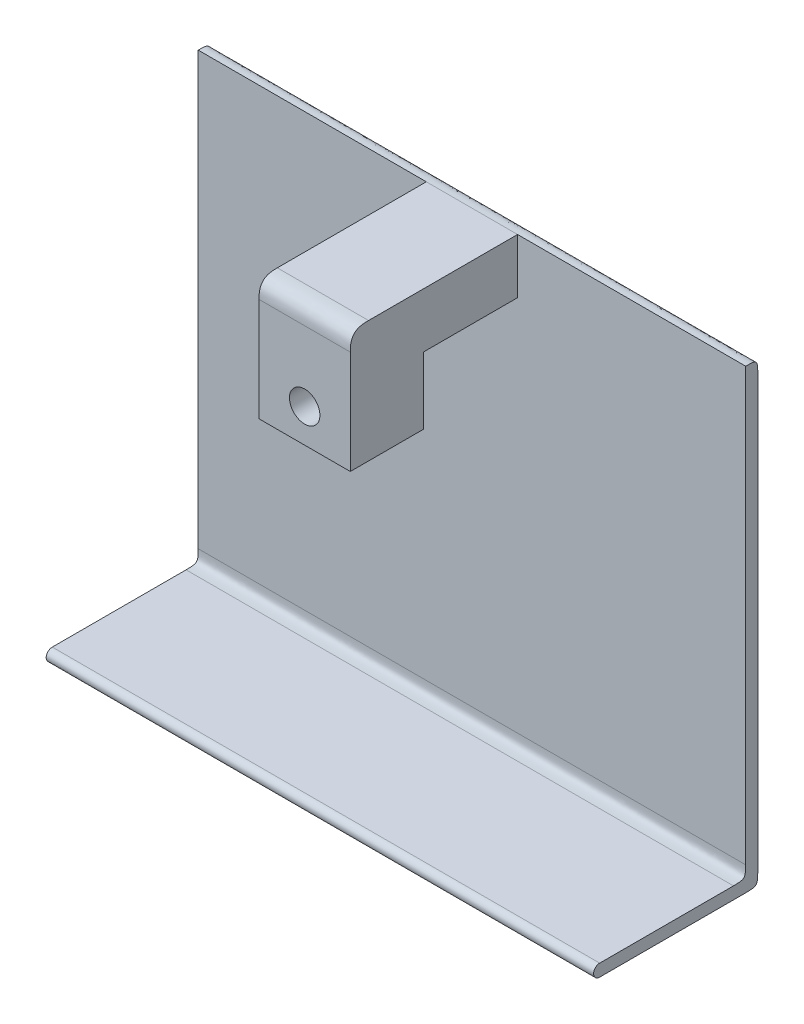
ISO-10303-21;
HEADER;
FILE_DESCRIPTION(('STEP AP214'),'2;1');
FILE_NAME('part.step','',(''),(''),'','','');
FILE_SCHEMA(('AUTOMOTIVE_DESIGN { 1 0 10303 214 1 1 1 1 }'));
ENDSEC;
DATA;
#1=APPLICATION_CONTEXT('core data for automotive mechanical design processes');
#2=APPLICATION_PROTOCOL_DEFINITION('international standard','automotive_design',2000,#1);
#3=PRODUCT_CONTEXT('',#1,'mechanical');
#4=PRODUCT('Part','Part','',(#3));
#5=PRODUCT_RELATED_PRODUCT_CATEGORY('part','',(#4));
#6=PRODUCT_DEFINITION_FORMATION('','',#4);
#7=PRODUCT_DEFINITION_CONTEXT('part definition',#1,'design');
#8=PRODUCT_DEFINITION('design','',#6,#7);
#9=PRODUCT_DEFINITION_SHAPE('','',#8);
#10=(LENGTH_UNIT() NAMED_UNIT(*) SI_UNIT(.MILLI.,.METRE.));
#11=(NAMED_UNIT(*) PLANE_ANGLE_UNIT() SI_UNIT($,.RADIAN.));
#12=(NAMED_UNIT(*) SI_UNIT($,.STERADIAN.) SOLID_ANGLE_UNIT());
#13=UNCERTAINTY_MEASURE_WITH_UNIT(LENGTH_MEASURE(1.E-05),#10,'distance_accuracy_value','');
#14=(GEOMETRIC_REPRESENTATION_CONTEXT(3) GLOBAL_UNCERTAINTY_ASSIGNED_CONTEXT((#13)) GLOBAL_UNIT_ASSIGNED_CONTEXT((#10,
#11,#12)) REPRESENTATION_CONTEXT('',''));
#15=CARTESIAN_POINT('',(0.,0.,0.));
#16=DIRECTION('',(0.,0.,1.));
#17=DIRECTION('',(1.,0.,0.));
#18=AXIS2_PLACEMENT_3D('',#15,#16,#17);
#19=CARTESIAN_POINT('',(-225.,-270.,12.5));
#20=DIRECTION('',(-1.,0.,0.));
#21=DIRECTION('',(0.,0.,1.));
#22=AXIS2_PLACEMENT_3D('',#19,#20,#21);
#23=CYLINDRICAL_SURFACE('',#22,5.);
#24=DIRECTION('',(-1.,0.,0.));
#25=VECTOR('',#24,1.);
#26=CARTESIAN_POINT('',(-225.,-265.,12.5));
#27=LINE('',#26,#25);
#28=CARTESIAN_POINT('',(-225.,-265.,12.5));
#29=VERTEX_POINT('',#28);
#30=CARTESIAN_POINT('',(225.,-265.,12.5));
#31=VERTEX_POINT('',#30);
#32=EDGE_CURVE('E488',#29,#31,#27,.F.);
#33=ORIENTED_EDGE('',*,*,#32,.F.);
#34=CARTESIAN_POINT('',(-225.,-270.,12.5));
#35=DIRECTION('',(1.,0.,0.));
#36=DIRECTION('',(0.,1.,0.));
#37=AXIS2_PLACEMENT_3D('',#34,#35,#36);
#38=CIRCLE('',#37,5.);
#39=CARTESIAN_POINT('',(-225.,-275.,12.5));
#40=VERTEX_POINT('',#39);
#41=EDGE_CURVE('E491',#40,#29,#38,.F.);
#42=ORIENTED_EDGE('',*,*,#41,.F.);
#43=DIRECTION('',(-1.,0.,0.));
#44=VECTOR('',#43,1.);
#45=CARTESIAN_POINT('',(-25.,-275.,12.5));
#46=LINE('',#45,#44);
#47=CARTESIAN_POINT('',(225.,-275.,12.5));
#48=VERTEX_POINT('',#47);
#49=EDGE_CURVE('E496',#48,#40,#46,.T.);
#50=ORIENTED_EDGE('',*,*,#49,.F.);
#51=CARTESIAN_POINT('',(225.,-270.,12.5));
#52=DIRECTION('',(-1.,0.,0.));
#53=DIRECTION('',(0.,-1.,0.));
#54=AXIS2_PLACEMENT_3D('',#51,#52,#53);
#55=CIRCLE('',#54,5.);
#56=EDGE_CURVE('E493',#31,#48,#55,.F.);
#57=ORIENTED_EDGE('',*,*,#56,.F.);
#58=EDGE_LOOP('',(#33,#42,#50,#57));
#59=FACE_BOUND('',#58,.T.);
#60=ADVANCED_FACE('F38',(#59),#23,.T.);
#61=CARTESIAN_POINT('',(0.,0.,-107.5));
#62=DIRECTION('',(0.,0.,-1.));
#63=DIRECTION('',(-1.,0.,0.));
#64=AXIS2_PLACEMENT_3D('',#61,#62,#63);
#65=PLANE('',#64);
#66=DIRECTION('',(0.,1.,0.));
#67=VECTOR('',#66,1.);
#68=CARTESIAN_POINT('',(-225.,100.,-107.5));
#69=LINE('',#68,#67);
#70=CARTESIAN_POINT('',(-225.,-255.,-107.5));
#71=VERTEX_POINT('',#70);
#72=CARTESIAN_POINT('',(-225.,100.,-107.5));
#73=VERTEX_POINT('',#72);
#74=EDGE_CURVE('E179',#71,#73,#69,.T.);
#75=ORIENTED_EDGE('',*,*,#74,.F.);
#76=CARTESIAN_POINT('',(247.5,-255.,-107.5));
#77=CARTESIAN_POINT('',(82.5,-255.,-107.5));
#78=CARTESIAN_POINT('',(-82.4999999999999,-255.,-107.5));
#79=CARTESIAN_POINT('',(-247.5,-255.,-107.5));
#80=(BOUNDED_CURVE() B_SPLINE_CURVE(3,(#76,#77,#78,#79),.UNSPECIFIED.,.F.,
.F.) B_SPLINE_CURVE_WITH_KNOTS((4,4),(-0.0225,0.4725),
.UNSPECIFIED.) CURVE() GEOMETRIC_REPRESENTATION_ITEM() RATIONAL_B_SPLINE_CURVE((1.,1.,1.,1.)) REPRESENTATION_ITEM(''));
#81=CARTESIAN_POINT('',(225.,-255.,-107.5));
#82=VERTEX_POINT('',#81);
#83=EDGE_CURVE('E177',#71,#82,#80,.F.);
#84=ORIENTED_EDGE('',*,*,#83,.T.);
#85=DIRECTION('',(0.,-1.,0.));
#86=VECTOR('',#85,1.);
#87=CARTESIAN_POINT('',(225.,100.,-107.5));
#88=LINE('',#87,#86);
#89=CARTESIAN_POINT('',(225.,100.,-107.5));
#90=VERTEX_POINT('',#89);
#91=EDGE_CURVE('E155',#90,#82,#88,.T.);
#92=ORIENTED_EDGE('',*,*,#91,.F.);
#93=CARTESIAN_POINT('',(-247.5,100.,-107.5));
#94=CARTESIAN_POINT('',(-82.5,100.,-107.5));
#95=CARTESIAN_POINT('',(82.5,100.,-107.5));
#96=CARTESIAN_POINT('',(247.5,100.,-107.5));
#97=(BOUNDED_CURVE() B_SPLINE_CURVE(3,(#93,#94,#95,#96),.UNSPECIFIED.,.F.,
.F.) B_SPLINE_CURVE_WITH_KNOTS((4,4),(-0.2475,0.2475),
.UNSPECIFIED.) CURVE() GEOMETRIC_REPRESENTATION_ITEM() RATIONAL_B_SPLINE_CURVE((1.,1.,1.,1.)) REPRESENTATION_ITEM(''));
#98=CARTESIAN_POINT('',(37.5,100.,-107.5));
#99=VERTEX_POINT('',#98);
#100=EDGE_CURVE('E173',#99,#90,#97,.T.);
#101=ORIENTED_EDGE('',*,*,#100,.F.);
#102=DIRECTION('',(0.,-1.,0.));
#103=VECTOR('',#102,1.);
#104=CARTESIAN_POINT('',(37.5,100.,-107.5));
#105=LINE('',#104,#103);
#106=CARTESIAN_POINT('',(37.5,55.,-107.5));
#107=VERTEX_POINT('',#106);
#108=EDGE_CURVE('E326',#99,#107,#105,.T.);
#109=ORIENTED_EDGE('',*,*,#108,.T.);
#110=DIRECTION('',(-1.,0.,0.));
#111=VECTOR('',#110,1.);
#112=CARTESIAN_POINT('',(37.5,55.,-107.5));
#113=LINE('',#112,#111);
#114=CARTESIAN_POINT('',(-37.5,55.,-107.5));
#115=VERTEX_POINT('',#114);
#116=EDGE_CURVE('E328',#107,#115,#113,.T.);
#117=ORIENTED_EDGE('',*,*,#116,.T.);
#118=DIRECTION('',(0.,1.,0.));
#119=VECTOR('',#118,1.);
#120=CARTESIAN_POINT('',(-37.5,100.,-107.5));
#121=LINE('',#120,#119);
#122=CARTESIAN_POINT('',(-37.5,100.,-107.5));
#123=VERTEX_POINT('',#122);
#124=EDGE_CURVE('E333',#115,#123,#121,.T.);
#125=ORIENTED_EDGE('',*,*,#124,.T.);
#126=CARTESIAN_POINT('',(-247.5,100.,-107.5));
#127=CARTESIAN_POINT('',(-82.5,100.,-107.5));
#128=CARTESIAN_POINT('',(82.5,100.,-107.5));
#129=CARTESIAN_POINT('',(247.5,100.,-107.5));
#130=(BOUNDED_CURVE() B_SPLINE_CURVE(3,(#126,#127,#128,#129),.UNSPECIFIED.,.F.,
.F.) B_SPLINE_CURVE_WITH_KNOTS((4,4),(-0.2475,0.2475),
.UNSPECIFIED.) CURVE() GEOMETRIC_REPRESENTATION_ITEM() RATIONAL_B_SPLINE_CURVE((1.,1.,1.,1.)) REPRESENTATION_ITEM(''));
#131=EDGE_CURVE('E188',#73,#123,#130,.T.);
#132=ORIENTED_EDGE('',*,*,#131,.F.);
#133=EDGE_LOOP('',(#75,#84,#92,#101,#109,#117,#125,#132));
#134=FACE_BOUND('',#133,.T.);
#135=ADVANCED_FACE('F171',(#134),#65,.F.);
#136=CARTESIAN_POINT('',(-37.5,100.,30.));
#137=DIRECTION('',(-1.,0.,0.));
#138=DIRECTION('',(0.,0.,1.));
#139=AXIS2_PLACEMENT_3D('',#136,#137,#138);
#140=PLANE('',#139);
#141=DIRECTION('',(0.,-1.,0.));
#142=VECTOR('',#141,1.);
#143=CARTESIAN_POINT('',(-37.5,100.,30.));
#144=LINE('',#143,#142);
#145=CARTESIAN_POINT('',(-37.5,85.,30.));
#146=VERTEX_POINT('',#145);
#147=CARTESIAN_POINT('',(-37.5,0.,30.));
#148=VERTEX_POINT('',#147);
#149=EDGE_CURVE('E397',#146,#148,#144,.T.);
#150=ORIENTED_EDGE('',*,*,#149,.F.);
#151=CARTESIAN_POINT('',(-37.5,100.,15.));
#152=CARTESIAN_POINT('',(-37.5,100.,17.5229707730092));
#153=CARTESIAN_POINT('',(-37.5,100.,20.0459415460184));
#154=CARTESIAN_POINT('',(-37.5,98.9246212024588,25.6066017177982));
#155=CARTESIAN_POINT('',(-37.5,95.6066017177982,28.9246212024587));
#156=CARTESIAN_POINT('',(-37.5,90.0459415460184,30.));
#157=CARTESIAN_POINT('',(-37.5,87.5229707730092,30.));
#158=CARTESIAN_POINT('',(-37.5,85.,30.));
#159=B_SPLINE_CURVE_WITH_KNOTS('',5,(#151,#152,#153,#154,#155,#156,#157,#158),.UNSPECIFIED.,.F.,
.F.,(6,2,6),(0.,0.5,1.),.UNSPECIFIED.);
#160=CARTESIAN_POINT('',(-37.5,100.,15.));
#161=VERTEX_POINT('',#160);
#162=EDGE_CURVE('E12',#146,#161,#159,.F.);
#163=ORIENTED_EDGE('',*,*,#162,.T.);
#164=DIRECTION('',(0.,0.,-1.));
#165=VECTOR('',#164,1.);
#166=CARTESIAN_POINT('',(-37.5,100.,30.));
#167=LINE('',#166,#165);
#168=EDGE_CURVE('E316',#161,#123,#167,.T.);
#169=ORIENTED_EDGE('',*,*,#168,.T.);
#170=ORIENTED_EDGE('',*,*,#124,.F.);
#171=DIRECTION('',(0.,0.,1.));
#172=VECTOR('',#171,1.);
#173=CARTESIAN_POINT('',(-37.5,55.,-107.5));
#174=LINE('',#173,#172);
#175=CARTESIAN_POINT('',(-37.5,55.,-30.));
#176=VERTEX_POINT('',#175);
#177=EDGE_CURVE('E336',#115,#176,#174,.T.);
#178=ORIENTED_EDGE('',*,*,#177,.T.);
#179=DIRECTION('',(0.,-1.,0.));
#180=VECTOR('',#179,1.);
#181=CARTESIAN_POINT('',(-37.5,100.,-30.));
#182=LINE('',#181,#180);
#183=CARTESIAN_POINT('',(-37.5,0.,-30.));
#184=VERTEX_POINT('',#183);
#185=EDGE_CURVE('E315',#176,#184,#182,.T.);
#186=ORIENTED_EDGE('',*,*,#185,.T.);
#187=DIRECTION('',(0.,0.,-1.));
#188=VECTOR('',#187,1.);
#189=CARTESIAN_POINT('',(-37.5,0.,30.));
#190=LINE('',#189,#188);
#191=EDGE_CURVE('E608',#148,#184,#190,.T.);
#192=ORIENTED_EDGE('',*,*,#191,.F.);
#193=EDGE_LOOP('',(#150,#163,#169,#170,#178,#186,#192));
#194=FACE_BOUND('',#193,.T.);
#195=ADVANCED_FACE('F446',(#194),#140,.T.);
#196=CARTESIAN_POINT('',(-37.5,100.,30.));
#197=DIRECTION('',(0.,0.,-1.));
#198=DIRECTION('',(-1.,0.,0.));
#199=AXIS2_PLACEMENT_3D('',#196,#197,#198);
#200=PLANE('',#199);
#201=CARTESIAN_POINT('',(0.,27.5013680983625,30.));
#202=DIRECTION('',(0.,0.,1.));
#203=DIRECTION('',(1.,0.,0.));
#204=AXIS2_PLACEMENT_3D('',#201,#202,#203);
#205=CIRCLE('',#204,12.5);
#206=CARTESIAN_POINT('',(12.5,27.5013680983625,30.));
#207=VERTEX_POINT('',#206);
#208=EDGE_CURVE('E509',#207,#207,#205,.T.);
#209=ORIENTED_EDGE('',*,*,#208,.F.);
#210=EDGE_LOOP('',(#209));
#211=FACE_BOUND('',#210,.T.);
#212=DIRECTION('',(0.,-1.,0.));
#213=VECTOR('',#212,1.);
#214=CARTESIAN_POINT('',(37.5,100.,30.));
#215=LINE('',#214,#213);
#216=CARTESIAN_POINT('',(37.5,85.,30.));
#217=VERTEX_POINT('',#216);
#218=CARTESIAN_POINT('',(37.5,0.,30.));
#219=VERTEX_POINT('',#218);
#220=EDGE_CURVE('E399',#217,#219,#215,.T.);
#221=ORIENTED_EDGE('',*,*,#220,.F.);
#222=CARTESIAN_POINT('',(-41.25,85.,30.));
#223=CARTESIAN_POINT('',(-13.75,85.,30.));
#224=CARTESIAN_POINT('',(13.75,85.,30.));
#225=CARTESIAN_POINT('',(41.25,85.,30.));
#226=B_SPLINE_CURVE_WITH_KNOTS('',3,(#222,#223,#224,#225),.UNSPECIFIED.,.F.,.F.,(4,4),(-0.04125,
0.04125),.UNSPECIFIED.);
#227=EDGE_CURVE('E51',#217,#146,#226,.F.);
#228=ORIENTED_EDGE('',*,*,#227,.T.);
#229=ORIENTED_EDGE('',*,*,#149,.T.);
#230=DIRECTION('',(1.,0.,0.));
#231=VECTOR('',#230,1.);
#232=CARTESIAN_POINT('',(-37.5,0.,30.));
#233=LINE('',#232,#231);
#234=EDGE_CURVE('E414',#148,#219,#233,.T.);
#235=ORIENTED_EDGE('',*,*,#234,.T.);
#236=EDGE_LOOP('',(#221,#228,#229,#235));
#237=FACE_BOUND('',#236,.T.);
#238=ADVANCED_FACE('F442',(#211,#237),#200,.F.);
#239=CARTESIAN_POINT('',(37.5,100.,30.));
#240=DIRECTION('',(-1.,0.,0.));
#241=DIRECTION('',(0.,0.,1.));
#242=AXIS2_PLACEMENT_3D('',#239,#240,#241);
#243=PLANE('',#242);
#244=DIRECTION('',(0.,0.,-1.));
#245=VECTOR('',#244,1.);
#246=CARTESIAN_POINT('',(37.5,100.,30.));
#247=LINE('',#246,#245);
#248=CARTESIAN_POINT('',(37.5,100.,15.));
#249=VERTEX_POINT('',#248);
#250=EDGE_CURVE('E307',#249,#99,#247,.T.);
#251=ORIENTED_EDGE('',*,*,#250,.F.);
#252=CARTESIAN_POINT('',(37.5,85.,30.));
#253=CARTESIAN_POINT('',(37.5,87.5229707730092,30.));
#254=CARTESIAN_POINT('',(37.5,90.0459415460184,30.));
#255=CARTESIAN_POINT('',(37.5,95.6066017177982,28.9246212024587));
#256=CARTESIAN_POINT('',(37.5,98.9246212024588,25.6066017177982));
#257=CARTESIAN_POINT('',(37.5,100.,20.0459415460184));
#258=CARTESIAN_POINT('',(37.5,100.,17.5229707730092));
#259=CARTESIAN_POINT('',(37.5,100.,15.));
#260=B_SPLINE_CURVE_WITH_KNOTS('',5,(#252,#253,#254,#255,#256,#257,#258,#259),.UNSPECIFIED.,.F.,
.F.,(6,2,6),(0.,0.5,1.),.UNSPECIFIED.);
#261=EDGE_CURVE('E66',#249,#217,#260,.F.);
#262=ORIENTED_EDGE('',*,*,#261,.T.);
#263=ORIENTED_EDGE('',*,*,#220,.T.);
#264=DIRECTION('',(0.,0.,-1.));
#265=VECTOR('',#264,1.);
#266=CARTESIAN_POINT('',(37.5,0.,30.));
#267=LINE('',#266,#265);
#268=CARTESIAN_POINT('',(37.5,0.,-30.));
#269=VERTEX_POINT('',#268);
#270=EDGE_CURVE('E602',#219,#269,#267,.T.);
#271=ORIENTED_EDGE('',*,*,#270,.T.);
#272=DIRECTION('',(0.,-1.,0.));
#273=VECTOR('',#272,1.);
#274=CARTESIAN_POINT('',(37.5,100.,-30.));
#275=LINE('',#274,#273);
#276=CARTESIAN_POINT('',(37.5,55.,-30.));
#277=VERTEX_POINT('',#276);
#278=EDGE_CURVE('E403',#277,#269,#275,.T.);
#279=ORIENTED_EDGE('',*,*,#278,.F.);
#280=DIRECTION('',(0.,0.,1.));
#281=VECTOR('',#280,1.);
#282=CARTESIAN_POINT('',(37.5,55.,-107.5));
#283=LINE('',#282,#281);
#284=EDGE_CURVE('E613',#107,#277,#283,.T.);
#285=ORIENTED_EDGE('',*,*,#284,.F.);
#286=ORIENTED_EDGE('',*,*,#108,.F.);
#287=EDGE_LOOP('',(#251,#262,#263,#271,#279,#285,#286));
#288=FACE_BOUND('',#287,.T.);
#289=ADVANCED_FACE('F445',(#288),#243,.F.);
#290=CARTESIAN_POINT('',(-37.5,100.,-30.));
#291=DIRECTION('',(0.,0.,-1.));
#292=DIRECTION('',(-1.,0.,0.));
#293=AXIS2_PLACEMENT_3D('',#290,#291,#292);
#294=PLANE('',#293);
#295=CARTESIAN_POINT('',(0.,27.5013680983625,-30.));
#296=DIRECTION('',(0.,0.,-1.));
#297=DIRECTION('',(-1.,0.,0.));
#298=AXIS2_PLACEMENT_3D('',#295,#296,#297);
#299=CIRCLE('',#298,12.5);
#300=CARTESIAN_POINT('',(-12.5,27.5013680983625,-30.));
#301=VERTEX_POINT('',#300);
#302=EDGE_CURVE('E505',#301,#301,#299,.T.);
#303=ORIENTED_EDGE('',*,*,#302,.F.);
#304=EDGE_LOOP('',(#303));
#305=FACE_BOUND('',#304,.T.);
#306=DIRECTION('',(-1.,0.,0.));
#307=VECTOR('',#306,1.);
#308=CARTESIAN_POINT('',(37.5,55.,-30.));
#309=LINE('',#308,#307);
#310=EDGE_CURVE('E329',#277,#176,#309,.T.);
#311=ORIENTED_EDGE('',*,*,#310,.F.);
#312=ORIENTED_EDGE('',*,*,#278,.T.);
#313=DIRECTION('',(1.,0.,0.));
#314=VECTOR('',#313,1.);
#315=CARTESIAN_POINT('',(-37.5,0.,-30.));
#316=LINE('',#315,#314);
#317=EDGE_CURVE('E605',#184,#269,#316,.T.);
#318=ORIENTED_EDGE('',*,*,#317,.F.);
#319=ORIENTED_EDGE('',*,*,#185,.F.);
#320=EDGE_LOOP('',(#311,#312,#318,#319));
#321=FACE_BOUND('',#320,.T.);
#322=ADVANCED_FACE('F434',(#305,#321),#294,.T.);
#323=CARTESIAN_POINT('',(0.,100.,0.));
#324=DIRECTION('',(0.,-1.,0.));
#325=DIRECTION('',(0.,0.,-1.));
#326=AXIS2_PLACEMENT_3D('',#323,#324,#325);
#327=PLANE('',#326);
#328=ORIENTED_EDGE('',*,*,#168,.F.);
#329=CARTESIAN_POINT('',(41.25,100.,15.));
#330=CARTESIAN_POINT('',(13.75,100.,15.));
#331=CARTESIAN_POINT('',(-13.75,100.,15.));
#332=CARTESIAN_POINT('',(-41.25,100.,15.));
#333=B_SPLINE_CURVE_WITH_KNOTS('',3,(#329,#330,#331,#332),.UNSPECIFIED.,.F.,.F.,(4,4),(-0.04125,
0.04125),.UNSPECIFIED.);
#334=EDGE_CURVE('E623',#161,#249,#333,.F.);
#335=ORIENTED_EDGE('',*,*,#334,.T.);
#336=ORIENTED_EDGE('',*,*,#250,.T.);
#337=CARTESIAN_POINT('',(-247.5,100.,-107.5));
#338=CARTESIAN_POINT('',(-82.5,100.,-107.5));
#339=CARTESIAN_POINT('',(82.5,100.,-107.5));
#340=CARTESIAN_POINT('',(247.5,100.,-107.5));
#341=(BOUNDED_CURVE() B_SPLINE_CURVE(3,(#337,#338,#339,#340),.UNSPECIFIED.,.F.,
.F.) B_SPLINE_CURVE_WITH_KNOTS((4,4),(-0.2475,0.2475),
.UNSPECIFIED.) CURVE() GEOMETRIC_REPRESENTATION_ITEM() RATIONAL_B_SPLINE_CURVE((1.,1.,1.,1.)) REPRESENTATION_ITEM(''));
#342=EDGE_CURVE('E186',#99,#123,#341,.F.);
#343=ORIENTED_EDGE('',*,*,#342,.T.);
#344=EDGE_LOOP('',(#328,#335,#336,#343));
#345=FACE_BOUND('',#344,.T.);
#346=ADVANCED_FACE('F423',(#345),#327,.F.);
#347=CARTESIAN_POINT('',(0.,0.,0.));
#348=DIRECTION('',(0.,-1.,0.));
#349=DIRECTION('',(0.,0.,-1.));
#350=AXIS2_PLACEMENT_3D('',#347,#348,#349);
#351=PLANE('',#350);
#352=ORIENTED_EDGE('',*,*,#191,.T.);
#353=ORIENTED_EDGE('',*,*,#317,.T.);
#354=ORIENTED_EDGE('',*,*,#270,.F.);
#355=ORIENTED_EDGE('',*,*,#234,.F.);
#356=EDGE_LOOP('',(#352,#353,#354,#355));
#357=FACE_BOUND('',#356,.T.);
#358=ADVANCED_FACE('F433',(#357),#351,.T.);
#359=CARTESIAN_POINT('',(37.5,55.,-107.5));
#360=DIRECTION('',(0.,1.,0.));
#361=DIRECTION('',(0.,0.,1.));
#362=AXIS2_PLACEMENT_3D('',#359,#360,#361);
#363=PLANE('',#362);
#364=ORIENTED_EDGE('',*,*,#310,.T.);
#365=ORIENTED_EDGE('',*,*,#177,.F.);
#366=ORIENTED_EDGE('',*,*,#116,.F.);
#367=ORIENTED_EDGE('',*,*,#284,.T.);
#368=EDGE_LOOP('',(#364,#365,#366,#367));
#369=FACE_BOUND('',#368,.T.);
#370=ADVANCED_FACE('F436',(#369),#363,.F.);
#371=CARTESIAN_POINT('',(225.,100.,-117.5));
#372=DIRECTION('',(-1.,0.,0.));
#373=DIRECTION('',(0.,-1.,0.));
#374=AXIS2_PLACEMENT_3D('',#371,#372,#373);
#375=PLANE('',#374);
#376=DIRECTION('',(0.,0.,-1.));
#377=VECTOR('',#376,1.);
#378=CARTESIAN_POINT('',(225.,-265.,17.5));
#379=LINE('',#378,#377);
#380=CARTESIAN_POINT('',(225.,-265.,-97.5));
#381=VERTEX_POINT('',#380);
#382=EDGE_CURVE('E180',#31,#381,#379,.T.);
#383=ORIENTED_EDGE('',*,*,#382,.F.);
#384=ORIENTED_EDGE('',*,*,#56,.T.);
#385=DIRECTION('',(0.,0.,1.));
#386=VECTOR('',#385,1.);
#387=CARTESIAN_POINT('',(225.,-275.,-117.5));
#388=LINE('',#387,#386);
#389=CARTESIAN_POINT('',(225.,-275.,-107.5));
#390=VERTEX_POINT('',#389);
#391=EDGE_CURVE('E555',#390,#48,#388,.T.);
#392=ORIENTED_EDGE('',*,*,#391,.F.);
#393=CARTESIAN_POINT('',(225.,-265.,-117.5));
#394=CARTESIAN_POINT('',(225.,-275.,-117.5));
#395=CARTESIAN_POINT('',(225.,-275.,-107.5));
#396=(BOUNDED_CURVE() B_SPLINE_CURVE(2,(#393,#394,#395),.UNSPECIFIED.,.F.,
.F.) B_SPLINE_CURVE_WITH_KNOTS((3,3),(0.,1.),
.UNSPECIFIED.) CURVE() GEOMETRIC_REPRESENTATION_ITEM() RATIONAL_B_SPLINE_CURVE((1.,
2.33333333333333,1.)) REPRESENTATION_ITEM(''));
#397=CARTESIAN_POINT('',(225.,-265.,-117.5));
#398=VERTEX_POINT('',#397);
#399=EDGE_CURVE('E164',#390,#398,#396,.F.);
#400=ORIENTED_EDGE('',*,*,#399,.T.);
#401=DIRECTION('',(0.,-1.,0.));
#402=VECTOR('',#401,1.);
#403=CARTESIAN_POINT('',(225.,100.,-117.5));
#404=LINE('',#403,#402);
#405=CARTESIAN_POINT('',(225.,90.,-117.5));
#406=VERTEX_POINT('',#405);
#407=EDGE_CURVE('E158',#406,#398,#404,.T.);
#408=ORIENTED_EDGE('',*,*,#407,.F.);
#409=CARTESIAN_POINT('',(225.,100.,-107.5));
#410=CARTESIAN_POINT('',(225.,100.,-117.5));
#411=CARTESIAN_POINT('',(225.,90.,-117.5));
#412=(BOUNDED_CURVE() B_SPLINE_CURVE(2,(#409,#410,#411),.UNSPECIFIED.,.F.,
.F.) B_SPLINE_CURVE_WITH_KNOTS((3,3),(0.,1.),
.UNSPECIFIED.) CURVE() GEOMETRIC_REPRESENTATION_ITEM() RATIONAL_B_SPLINE_CURVE((1.,
2.33333333333333,1.)) REPRESENTATION_ITEM(''));
#413=EDGE_CURVE('E150',#406,#90,#412,.F.);
#414=ORIENTED_EDGE('',*,*,#413,.T.);
#415=ORIENTED_EDGE('',*,*,#91,.T.);
#416=CARTESIAN_POINT('',(225.,-265.,-97.5));
#417=CARTESIAN_POINT('',(225.,-265.,-107.5));
#418=CARTESIAN_POINT('',(225.,-255.,-107.5));
#419=(BOUNDED_CURVE() B_SPLINE_CURVE(2,(#416,#417,#418),.UNSPECIFIED.,.F.,
.F.) B_SPLINE_CURVE_WITH_KNOTS((3,3),(0.,1.),
.UNSPECIFIED.) CURVE() GEOMETRIC_REPRESENTATION_ITEM() RATIONAL_B_SPLINE_CURVE((1.,
2.33333333333333,1.)) REPRESENTATION_ITEM(''));
#420=EDGE_CURVE('E648',#82,#381,#419,.F.);
#421=ORIENTED_EDGE('',*,*,#420,.T.);
#422=EDGE_LOOP('',(#383,#384,#392,#400,#408,#414,#415,#421));
#423=FACE_BOUND('',#422,.T.);
#424=ADVANCED_FACE('F154',(#423),#375,.F.);
#425=CARTESIAN_POINT('',(-25.,-275.,-117.5));
#426=DIRECTION('',(0.,1.,0.));
#427=DIRECTION('',(0.,0.,1.));
#428=AXIS2_PLACEMENT_3D('',#425,#426,#427);
#429=PLANE('',#428);
#430=ORIENTED_EDGE('',*,*,#391,.T.);
#431=ORIENTED_EDGE('',*,*,#49,.T.);
#432=DIRECTION('',(0.,0.,1.));
#433=VECTOR('',#432,1.);
#434=CARTESIAN_POINT('',(-225.,-275.,-117.5));
#435=LINE('',#434,#433);
#436=CARTESIAN_POINT('',(-225.,-275.,-107.5));
#437=VERTEX_POINT('',#436);
#438=EDGE_CURVE('E526',#437,#40,#435,.T.);
#439=ORIENTED_EDGE('',*,*,#438,.F.);
#440=CARTESIAN_POINT('',(247.5,-275.,-107.5));
#441=CARTESIAN_POINT('',(82.5000000000001,-275.,-107.5));
#442=CARTESIAN_POINT('',(-82.5000000000002,-275.,-107.5));
#443=CARTESIAN_POINT('',(-247.5,-275.,-107.5));
#444=(BOUNDED_CURVE() B_SPLINE_CURVE(3,(#440,#441,#442,#443),.UNSPECIFIED.,.F.,
.F.) B_SPLINE_CURVE_WITH_KNOTS((4,4),(-0.2475,0.2475),
.UNSPECIFIED.) CURVE() GEOMETRIC_REPRESENTATION_ITEM() RATIONAL_B_SPLINE_CURVE((1.,1.,1.,1.)) REPRESENTATION_ITEM(''));
#445=EDGE_CURVE('E165',#437,#390,#444,.F.);
#446=ORIENTED_EDGE('',*,*,#445,.T.);
#447=EDGE_LOOP('',(#430,#431,#439,#446));
#448=FACE_BOUND('',#447,.T.);
#449=ADVANCED_FACE('F569',(#448),#429,.F.);
#450=CARTESIAN_POINT('',(-225.,100.,-117.5));
#451=DIRECTION('',(1.,0.,0.));
#452=DIRECTION('',(0.,1.,0.));
#453=AXIS2_PLACEMENT_3D('',#450,#451,#452);
#454=PLANE('',#453);
#455=ORIENTED_EDGE('',*,*,#438,.T.);
#456=ORIENTED_EDGE('',*,*,#41,.T.);
#457=DIRECTION('',(0.,0.,-1.));
#458=VECTOR('',#457,1.);
#459=CARTESIAN_POINT('',(-225.,-265.,17.5));
#460=LINE('',#459,#458);
#461=CARTESIAN_POINT('',(-225.,-265.,-97.5));
#462=VERTEX_POINT('',#461);
#463=EDGE_CURVE('E500',#29,#462,#460,.T.);
#464=ORIENTED_EDGE('',*,*,#463,.T.);
#465=CARTESIAN_POINT('',(-225.,-255.,-107.5));
#466=CARTESIAN_POINT('',(-225.,-265.,-107.5));
#467=CARTESIAN_POINT('',(-225.,-265.,-97.5));
#468=(BOUNDED_CURVE() B_SPLINE_CURVE(2,(#465,#466,#467),.UNSPECIFIED.,.F.,
.F.) B_SPLINE_CURVE_WITH_KNOTS((3,3),(0.,1.),
.UNSPECIFIED.) CURVE() GEOMETRIC_REPRESENTATION_ITEM() RATIONAL_B_SPLINE_CURVE((1.,
2.33333333333333,1.)) REPRESENTATION_ITEM(''));
#469=EDGE_CURVE('E649',#462,#71,#468,.F.);
#470=ORIENTED_EDGE('',*,*,#469,.T.);
#471=ORIENTED_EDGE('',*,*,#74,.T.);
#472=CARTESIAN_POINT('',(-225.,90.,-117.5));
#473=CARTESIAN_POINT('',(-225.,100.,-117.5));
#474=CARTESIAN_POINT('',(-225.,100.,-107.5));
#475=(BOUNDED_CURVE() B_SPLINE_CURVE(2,(#472,#473,#474),.UNSPECIFIED.,.F.,
.F.) B_SPLINE_CURVE_WITH_KNOTS((3,3),(0.,1.),
.UNSPECIFIED.) CURVE() GEOMETRIC_REPRESENTATION_ITEM() RATIONAL_B_SPLINE_CURVE((1.,
2.33333333333333,1.)) REPRESENTATION_ITEM(''));
#476=CARTESIAN_POINT('',(-225.,90.,-117.5));
#477=VERTEX_POINT('',#476);
#478=EDGE_CURVE('E386',#73,#477,#475,.F.);
#479=ORIENTED_EDGE('',*,*,#478,.T.);
#480=DIRECTION('',(0.,1.,0.));
#481=VECTOR('',#480,1.);
#482=CARTESIAN_POINT('',(-225.,100.,-117.5));
#483=LINE('',#482,#481);
#484=CARTESIAN_POINT('',(-225.,-265.,-117.5));
#485=VERTEX_POINT('',#484);
#486=EDGE_CURVE('E525',#485,#477,#483,.T.);
#487=ORIENTED_EDGE('',*,*,#486,.F.);
#488=CARTESIAN_POINT('',(-225.,-275.,-107.5));
#489=CARTESIAN_POINT('',(-225.,-275.,-117.5));
#490=CARTESIAN_POINT('',(-225.,-265.,-117.5));
#491=(BOUNDED_CURVE() B_SPLINE_CURVE(2,(#488,#489,#490),.UNSPECIFIED.,.F.,
.F.) B_SPLINE_CURVE_WITH_KNOTS((3,3),(0.,1.),
.UNSPECIFIED.) CURVE() GEOMETRIC_REPRESENTATION_ITEM() RATIONAL_B_SPLINE_CURVE((1.,
2.33333333333333,1.)) REPRESENTATION_ITEM(''));
#492=EDGE_CURVE('E343',#485,#437,#491,.F.);
#493=ORIENTED_EDGE('',*,*,#492,.T.);
#494=EDGE_LOOP('',(#455,#456,#464,#470,#471,#479,#487,#493));
#495=FACE_BOUND('',#494,.T.);
#496=ADVANCED_FACE('F541',(#495),#454,.F.);
#497=CARTESIAN_POINT('',(0.,0.,-117.5));
#498=DIRECTION('',(0.,0.,-1.));
#499=DIRECTION('',(-1.,0.,0.));
#500=AXIS2_PLACEMENT_3D('',#497,#498,#499);
#501=PLANE('',#500);
#502=ORIENTED_EDGE('',*,*,#407,.T.);
#503=CARTESIAN_POINT('',(-247.5,-265.,-117.5));
#504=CARTESIAN_POINT('',(-82.5000000000002,-265.,-117.5));
#505=CARTESIAN_POINT('',(82.5000000000001,-265.,-117.5));
#506=CARTESIAN_POINT('',(247.5,-265.,-117.5));
#507=(BOUNDED_CURVE() B_SPLINE_CURVE(3,(#503,#504,#505,#506),.UNSPECIFIED.,.F.,
.F.) B_SPLINE_CURVE_WITH_KNOTS((4,4),(-0.2475,0.2475),
.UNSPECIFIED.) CURVE() GEOMETRIC_REPRESENTATION_ITEM() RATIONAL_B_SPLINE_CURVE((1.,1.,1.,1.)) REPRESENTATION_ITEM(''));
#508=EDGE_CURVE('E355',#398,#485,#507,.F.);
#509=ORIENTED_EDGE('',*,*,#508,.T.);
#510=ORIENTED_EDGE('',*,*,#486,.T.);
#511=CARTESIAN_POINT('',(247.5,90.,-117.5));
#512=CARTESIAN_POINT('',(82.5,90.,-117.5));
#513=CARTESIAN_POINT('',(-82.5,90.,-117.5));
#514=CARTESIAN_POINT('',(-247.5,90.,-117.5));
#515=(BOUNDED_CURVE() B_SPLINE_CURVE(3,(#511,#512,#513,#514),.UNSPECIFIED.,.F.,
.F.) B_SPLINE_CURVE_WITH_KNOTS((4,4),(-0.2475,0.2475),
.UNSPECIFIED.) CURVE() GEOMETRIC_REPRESENTATION_ITEM() RATIONAL_B_SPLINE_CURVE((1.,1.,1.,1.)) REPRESENTATION_ITEM(''));
#516=EDGE_CURVE('E394',#477,#406,#515,.F.);
#517=ORIENTED_EDGE('',*,*,#516,.T.);
#518=EDGE_LOOP('',(#502,#509,#510,#517));
#519=FACE_BOUND('',#518,.T.);
#520=ADVANCED_FACE('F532',(#519),#501,.T.);
#521=CARTESIAN_POINT('',(-225.,-265.,17.5));
#522=DIRECTION('',(0.,-1.,0.));
#523=DIRECTION('',(0.,0.,-1.));
#524=AXIS2_PLACEMENT_3D('',#521,#522,#523);
#525=PLANE('',#524);
#526=ORIENTED_EDGE('',*,*,#382,.T.);
#527=CARTESIAN_POINT('',(-247.5,-265.,-97.5));
#528=CARTESIAN_POINT('',(-82.4999999999999,-265.,-97.5));
#529=CARTESIAN_POINT('',(82.5,-265.,-97.5));
#530=CARTESIAN_POINT('',(247.5,-265.,-97.5));
#531=(BOUNDED_CURVE() B_SPLINE_CURVE(3,(#527,#528,#529,#530),.UNSPECIFIED.,.F.,
.F.) B_SPLINE_CURVE_WITH_KNOTS((4,4),(-0.0225,0.4725),
.UNSPECIFIED.) CURVE() GEOMETRIC_REPRESENTATION_ITEM() RATIONAL_B_SPLINE_CURVE((1.,1.,1.,1.)) REPRESENTATION_ITEM(''));
#532=EDGE_CURVE('E503',#381,#462,#531,.F.);
#533=ORIENTED_EDGE('',*,*,#532,.T.);
#534=ORIENTED_EDGE('',*,*,#463,.F.);
#535=ORIENTED_EDGE('',*,*,#32,.T.);
#536=EDGE_LOOP('',(#526,#533,#534,#535));
#537=FACE_BOUND('',#536,.T.);
#538=ADVANCED_FACE('F501',(#537),#525,.F.);
#539=CARTESIAN_POINT('',(0.,27.5013680983625,-95.));
#540=DIRECTION('',(0.,0.,1.));
#541=DIRECTION('',(1.,0.,0.));
#542=AXIS2_PLACEMENT_3D('',#539,#540,#541);
#543=CYLINDRICAL_SURFACE('',#542,12.5);
#544=ORIENTED_EDGE('',*,*,#302,.T.);
#545=EDGE_LOOP('',(#544));
#546=FACE_BOUND('',#545,.T.);
#547=ORIENTED_EDGE('',*,*,#208,.T.);
#548=EDGE_LOOP('',(#547));
#549=FACE_BOUND('',#548,.T.);
#550=ADVANCED_FACE('F686',(#546,#549),#543,.F.);
#551=CARTESIAN_POINT('',(-247.5,-275.,-107.5));
#552=CARTESIAN_POINT('',(-82.5000000000002,-275.,-107.5));
#553=CARTESIAN_POINT('',(82.5000000000001,-275.,-107.5));
#554=CARTESIAN_POINT('',(247.5,-275.,-107.5));
#555=CARTESIAN_POINT('',(-247.5,-275.,-117.5));
#556=CARTESIAN_POINT('',(-82.5000000000002,-275.,-117.5));
#557=CARTESIAN_POINT('',(82.5000000000001,-275.,-117.5));
#558=CARTESIAN_POINT('',(247.5,-275.,-117.5));
#559=CARTESIAN_POINT('',(-247.5,-265.,-117.5));
#560=CARTESIAN_POINT('',(-82.5000000000002,-265.,-117.5));
#561=CARTESIAN_POINT('',(82.5000000000001,-265.,-117.5));
#562=CARTESIAN_POINT('',(247.5,-265.,-117.5));
#563=(BOUNDED_SURFACE() B_SPLINE_SURFACE(2,3,((#551,#552,#553,#554),(#555,#556,#557,#558),(#559,
#560,#561,#562)),.UNSPECIFIED.,.F.,.F.,.F.) B_SPLINE_SURFACE_WITH_KNOTS((3,3),(4,4),(0.,1.),
(-0.2475,0.2475),.UNSPECIFIED.) GEOMETRIC_REPRESENTATION_ITEM() RATIONAL_B_SPLINE_SURFACE(((1.,
1.,1.,1.),(2.33333333333333,2.33333333333333,2.33333333333333,2.33333333333333),(1.,1.,1.,1.))) REPRESENTATION_ITEM('') SURFACE());
#564=ORIENTED_EDGE('',*,*,#399,.F.);
#565=ORIENTED_EDGE('',*,*,#445,.F.);
#566=ORIENTED_EDGE('',*,*,#492,.F.);
#567=ORIENTED_EDGE('',*,*,#508,.F.);
#568=EDGE_LOOP('',(#564,#565,#566,#567));
#569=FACE_BOUND('',#568,.T.);
#570=ADVANCED_FACE('F214',(#569),#563,.T.);
#571=CARTESIAN_POINT('',(247.5,100.,-107.5));
#572=CARTESIAN_POINT('',(82.5,100.,-107.5));
#573=CARTESIAN_POINT('',(-82.5,100.,-107.5));
#574=CARTESIAN_POINT('',(-247.5,100.,-107.5));
#575=CARTESIAN_POINT('',(247.5,100.,-117.5));
#576=CARTESIAN_POINT('',(82.5000000000001,100.,-117.5));
#577=CARTESIAN_POINT('',(-82.5000000000001,100.,-117.5));
#578=CARTESIAN_POINT('',(-247.5,100.,-117.5));
#579=CARTESIAN_POINT('',(247.5,90.,-117.5));
#580=CARTESIAN_POINT('',(82.5,90.,-117.5));
#581=CARTESIAN_POINT('',(-82.5,90.,-117.5));
#582=CARTESIAN_POINT('',(-247.5,90.,-117.5));
#583=(BOUNDED_SURFACE() B_SPLINE_SURFACE(2,3,((#571,#572,#573,#574),(#575,#576,#577,#578),(#579,
#580,#581,#582)),.UNSPECIFIED.,.F.,.F.,.F.) B_SPLINE_SURFACE_WITH_KNOTS((3,3),(4,4),(0.,1.),
(-0.2475,0.2475),.UNSPECIFIED.) GEOMETRIC_REPRESENTATION_ITEM() RATIONAL_B_SPLINE_SURFACE(((1.,
1.,1.,1.),(2.33333333333333,2.33333333333333,2.33333333333333,2.33333333333333),(1.,1.,1.,1.))) REPRESENTATION_ITEM('') SURFACE());
#584=ORIENTED_EDGE('',*,*,#342,.F.);
#585=ORIENTED_EDGE('',*,*,#100,.T.);
#586=ORIENTED_EDGE('',*,*,#413,.F.);
#587=ORIENTED_EDGE('',*,*,#516,.F.);
#588=ORIENTED_EDGE('',*,*,#478,.F.);
#589=ORIENTED_EDGE('',*,*,#131,.T.);
#590=EDGE_LOOP('',(#584,#585,#586,#587,#588,#589));
#591=FACE_BOUND('',#590,.T.);
#592=ADVANCED_FACE('F183',(#591),#583,.T.);
#593=CARTESIAN_POINT('',(-247.5,-255.,-107.5));
#594=CARTESIAN_POINT('',(-82.4999999999999,-255.,-107.5));
#595=CARTESIAN_POINT('',(82.5,-255.,-107.5));
#596=CARTESIAN_POINT('',(247.5,-255.,-107.5));
#597=CARTESIAN_POINT('',(-247.5,-265.,-107.5));
#598=CARTESIAN_POINT('',(-82.4999999999999,-265.,-107.5));
#599=CARTESIAN_POINT('',(82.5,-265.,-107.5));
#600=CARTESIAN_POINT('',(247.5,-265.,-107.5));
#601=CARTESIAN_POINT('',(-247.5,-265.,-97.5));
#602=CARTESIAN_POINT('',(-82.4999999999999,-265.,-97.5));
#603=CARTESIAN_POINT('',(82.5,-265.,-97.5));
#604=CARTESIAN_POINT('',(247.5,-265.,-97.5));
#605=(BOUNDED_SURFACE() B_SPLINE_SURFACE(2,3,((#593,#594,#595,#596),(#597,#598,#599,#600),(#601,
#602,#603,#604)),.UNSPECIFIED.,.F.,.F.,.F.) B_SPLINE_SURFACE_WITH_KNOTS((3,3),(4,4),(0.,1.),
(-0.0225,0.4725),.UNSPECIFIED.) GEOMETRIC_REPRESENTATION_ITEM() RATIONAL_B_SPLINE_SURFACE(((1.,
1.,1.,1.),(2.33333333333333,2.33333333333333,2.33333333333333,2.33333333333333),(1.,1.,1.,1.))) REPRESENTATION_ITEM('') SURFACE());
#606=ORIENTED_EDGE('',*,*,#420,.F.);
#607=ORIENTED_EDGE('',*,*,#83,.F.);
#608=ORIENTED_EDGE('',*,*,#469,.F.);
#609=ORIENTED_EDGE('',*,*,#532,.F.);
#610=EDGE_LOOP('',(#606,#607,#608,#609));
#611=FACE_BOUND('',#610,.T.);
#612=ADVANCED_FACE('F213',(#611),#605,.T.);
#613=CARTESIAN_POINT('',(-41.25,100.,15.));
#614=CARTESIAN_POINT('',(-13.75,100.,15.));
#615=CARTESIAN_POINT('',(13.75,100.,15.));
#616=CARTESIAN_POINT('',(41.25,100.,15.));
#617=CARTESIAN_POINT('',(-41.25,100.,17.5229707730092));
#618=CARTESIAN_POINT('',(-13.75,100.,17.5229707730092));
#619=CARTESIAN_POINT('',(13.75,100.,17.5229707730092));
#620=CARTESIAN_POINT('',(41.25,100.,17.5229707730092));
#621=CARTESIAN_POINT('',(-41.25,100.,20.0459415460184));
#622=CARTESIAN_POINT('',(-13.75,100.,20.0459415460184));
#623=CARTESIAN_POINT('',(13.75,100.,20.0459415460184));
#624=CARTESIAN_POINT('',(41.25,100.,20.0459415460184));
#625=CARTESIAN_POINT('',(-41.25,98.9246212024588,25.6066017177982));
#626=CARTESIAN_POINT('',(-13.75,98.9246212024588,25.6066017177982));
#627=CARTESIAN_POINT('',(13.75,98.9246212024588,25.6066017177982));
#628=CARTESIAN_POINT('',(41.25,98.9246212024588,25.6066017177982));
#629=CARTESIAN_POINT('',(-41.25,95.6066017177982,28.9246212024587));
#630=CARTESIAN_POINT('',(-13.75,95.6066017177982,28.9246212024587));
#631=CARTESIAN_POINT('',(13.75,95.6066017177982,28.9246212024587));
#632=CARTESIAN_POINT('',(41.25,95.6066017177982,28.9246212024587));
#633=CARTESIAN_POINT('',(-41.25,90.0459415460184,30.));
#634=CARTESIAN_POINT('',(-13.75,90.0459415460184,30.));
#635=CARTESIAN_POINT('',(13.75,90.0459415460184,30.));
#636=CARTESIAN_POINT('',(41.25,90.0459415460184,30.));
#637=CARTESIAN_POINT('',(-41.25,87.5229707730092,30.));
#638=CARTESIAN_POINT('',(-13.75,87.5229707730092,30.));
#639=CARTESIAN_POINT('',(13.75,87.5229707730092,30.));
#640=CARTESIAN_POINT('',(41.25,87.5229707730092,30.));
#641=CARTESIAN_POINT('',(-41.25,85.,30.));
#642=CARTESIAN_POINT('',(-13.75,85.,30.));
#643=CARTESIAN_POINT('',(13.75,85.,30.));
#644=CARTESIAN_POINT('',(41.25,85.,30.));
#645=B_SPLINE_SURFACE_WITH_KNOTS('',5,3,((#613,#614,#615,#616),(#617,#618,#619,#620),(#621,#622,
#623,#624),(#625,#626,#627,#628),(#629,#630,#631,#632),(#633,#634,#635,#636),(#637,#638,#639,
#640),(#641,#642,#643,#644)),.UNSPECIFIED.,.F.,.F.,.F.,(6,2,6),(4,4),(0.,0.5,1.),(-0.04125,
0.04125),.UNSPECIFIED.);
#646=ORIENTED_EDGE('',*,*,#162,.F.);
#647=ORIENTED_EDGE('',*,*,#227,.F.);
#648=ORIENTED_EDGE('',*,*,#261,.F.);
#649=ORIENTED_EDGE('',*,*,#334,.F.);
#650=EDGE_LOOP('',(#646,#647,#648,#649));
#651=FACE_BOUND('',#650,.T.);
#652=ADVANCED_FACE('F41',(#651),#645,.T.);
#653=CLOSED_SHELL('',(#60,#135,#195,#238,#289,#322,#346,#358,#370,#424,#449,#496,#520,#538,#550,
#570,#592,#612,#652));
#654=MANIFOLD_SOLID_BREP('B2',#653);
#655=ADVANCED_BREP_SHAPE_REPRESENTATION('',(#18,#654),#14);
#656=SHAPE_DEFINITION_REPRESENTATION(#9,#655);
ENDSEC;
END-ISO-10303-21;
